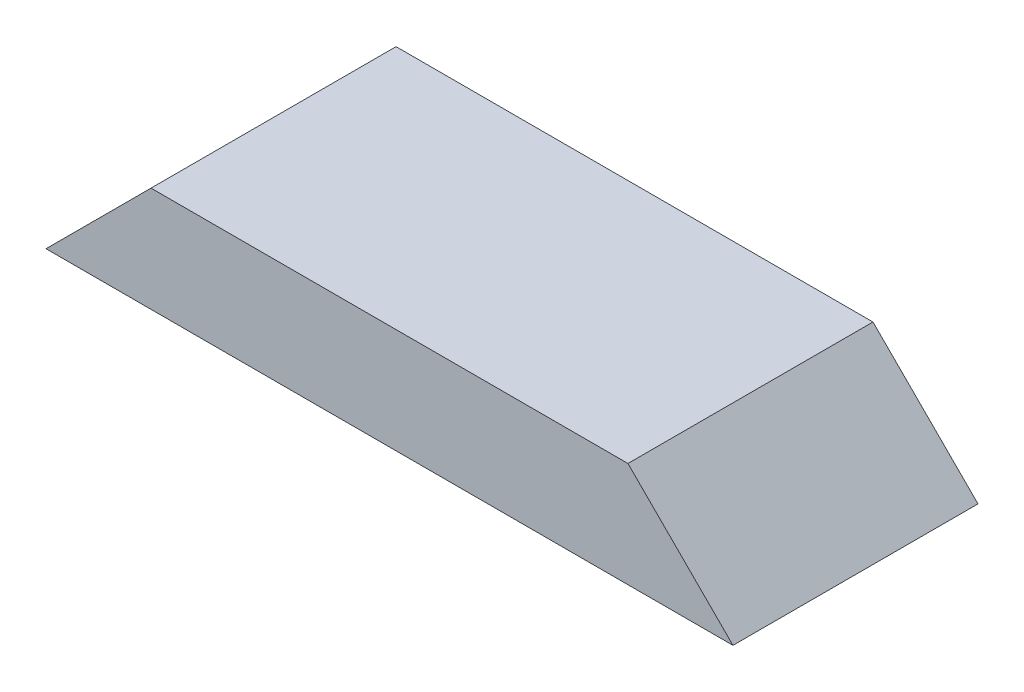
ISO-10303-21;
HEADER;
FILE_DESCRIPTION(('STEP AP214'),'2;1');
FILE_NAME('part.step','',(''),(''),'','','');
FILE_SCHEMA(('AUTOMOTIVE_DESIGN { 1 0 10303 214 1 1 1 1 }'));
ENDSEC;
DATA;
#1=APPLICATION_CONTEXT('core data for automotive mechanical design processes');
#2=APPLICATION_PROTOCOL_DEFINITION('international standard','automotive_design',2000,#1);
#3=PRODUCT_CONTEXT('',#1,'mechanical');
#4=PRODUCT('Part','Part','',(#3));
#5=PRODUCT_RELATED_PRODUCT_CATEGORY('part','',(#4));
#6=PRODUCT_DEFINITION_FORMATION('','',#4);
#7=PRODUCT_DEFINITION_CONTEXT('part definition',#1,'design');
#8=PRODUCT_DEFINITION('design','',#6,#7);
#9=PRODUCT_DEFINITION_SHAPE('','',#8);
#10=(LENGTH_UNIT() NAMED_UNIT(*) SI_UNIT(.MILLI.,.METRE.));
#11=(NAMED_UNIT(*) PLANE_ANGLE_UNIT() SI_UNIT($,.RADIAN.));
#12=(NAMED_UNIT(*) SI_UNIT($,.STERADIAN.) SOLID_ANGLE_UNIT());
#13=UNCERTAINTY_MEASURE_WITH_UNIT(LENGTH_MEASURE(1.E-05),#10,'distance_accuracy_value','');
#14=(GEOMETRIC_REPRESENTATION_CONTEXT(3) GLOBAL_UNCERTAINTY_ASSIGNED_CONTEXT((#13)) GLOBAL_UNIT_ASSIGNED_CONTEXT((#10,
#11,#12)) REPRESENTATION_CONTEXT('',''));
#15=CARTESIAN_POINT('',(0.,0.,0.));
#16=DIRECTION('',(0.,0.,1.));
#17=DIRECTION('',(1.,0.,0.));
#18=AXIS2_PLACEMENT_3D('',#15,#16,#17);
#19=CARTESIAN_POINT('',(0.,38.1,0.));
#20=DIRECTION('',(0.,0.,-1.));
#21=DIRECTION('',(-1.,0.,0.));
#22=AXIS2_PLACEMENT_3D('',#19,#20,#21);
#23=PLANE('',#22);
#24=DIRECTION('',(1.,0.,0.));
#25=VECTOR('',#24,1.);
#26=CARTESIAN_POINT('',(0.,38.1,0.));
#27=LINE('',#26,#25);
#28=CARTESIAN_POINT('',(38.1,38.1,0.));
#29=VERTEX_POINT('',#28);
#30=CARTESIAN_POINT('',(211.1375,38.1,0.));
#31=VERTEX_POINT('',#30);
#32=EDGE_CURVE('E46',#29,#31,#27,.T.);
#33=ORIENTED_EDGE('',*,*,#32,.F.);
#34=DIRECTION('',(0.707106781186547,0.707106781186547,0.));
#35=VECTOR('',#34,1.);
#36=CARTESIAN_POINT('',(0.,0.,0.));
#37=LINE('',#36,#35);
#38=CARTESIAN_POINT('',(0.,0.,0.));
#39=VERTEX_POINT('',#38);
#40=EDGE_CURVE('E81',#39,#29,#37,.T.);
#41=ORIENTED_EDGE('',*,*,#40,.F.);
#42=DIRECTION('',(1.,0.,0.));
#43=VECTOR('',#42,1.);
#44=CARTESIAN_POINT('',(0.,0.,0.));
#45=LINE('',#44,#43);
#46=CARTESIAN_POINT('',(249.2375,0.,0.));
#47=VERTEX_POINT('',#46);
#48=EDGE_CURVE('E86',#39,#47,#45,.T.);
#49=ORIENTED_EDGE('',*,*,#48,.T.);
#50=DIRECTION('',(0.707106781186547,-0.707106781186548,0.));
#51=VECTOR('',#50,1.);
#52=CARTESIAN_POINT('',(249.2375,0.,0.));
#53=LINE('',#52,#51);
#54=EDGE_CURVE('E62',#31,#47,#53,.T.);
#55=ORIENTED_EDGE('',*,*,#54,.F.);
#56=EDGE_LOOP('',(#33,#41,#49,#55));
#57=FACE_BOUND('',#56,.T.);
#58=ADVANCED_FACE('F38',(#57),#23,.F.);
#59=CARTESIAN_POINT('',(0.,38.1,-88.9));
#60=DIRECTION('',(0.,0.,1.));
#61=DIRECTION('',(1.,0.,0.));
#62=AXIS2_PLACEMENT_3D('',#59,#60,#61);
#63=PLANE('',#62);
#64=DIRECTION('',(-1.,0.,0.));
#65=VECTOR('',#64,1.);
#66=CARTESIAN_POINT('',(0.,0.,-88.9));
#67=LINE('',#66,#65);
#68=CARTESIAN_POINT('',(249.2375,0.,-88.9));
#69=VERTEX_POINT('',#68);
#70=CARTESIAN_POINT('',(0.,0.,-88.9));
#71=VERTEX_POINT('',#70);
#72=EDGE_CURVE('E41',#69,#71,#67,.T.);
#73=ORIENTED_EDGE('',*,*,#72,.T.);
#74=DIRECTION('',(0.707106781186547,0.707106781186547,0.));
#75=VECTOR('',#74,1.);
#76=CARTESIAN_POINT('',(0.,0.,-88.9));
#77=LINE('',#76,#75);
#78=CARTESIAN_POINT('',(38.1,38.1,-88.9));
#79=VERTEX_POINT('',#78);
#80=EDGE_CURVE('E54',#71,#79,#77,.T.);
#81=ORIENTED_EDGE('',*,*,#80,.T.);
#82=DIRECTION('',(-1.,0.,0.));
#83=VECTOR('',#82,1.);
#84=CARTESIAN_POINT('',(0.,38.1,-88.9));
#85=LINE('',#84,#83);
#86=CARTESIAN_POINT('',(211.1375,38.1,-88.9));
#87=VERTEX_POINT('',#86);
#88=EDGE_CURVE('E11',#87,#79,#85,.T.);
#89=ORIENTED_EDGE('',*,*,#88,.F.);
#90=DIRECTION('',(0.707106781186547,-0.707106781186548,0.));
#91=VECTOR('',#90,1.);
#92=CARTESIAN_POINT('',(249.2375,0.,-88.9));
#93=LINE('',#92,#91);
#94=EDGE_CURVE('E99',#87,#69,#93,.T.);
#95=ORIENTED_EDGE('',*,*,#94,.T.);
#96=EDGE_LOOP('',(#73,#81,#89,#95));
#97=FACE_BOUND('',#96,.T.);
#98=ADVANCED_FACE('F108',(#97),#63,.F.);
#99=CARTESIAN_POINT('',(0.,38.1,0.));
#100=DIRECTION('',(0.,-1.,0.));
#101=DIRECTION('',(0.,0.,-1.));
#102=AXIS2_PLACEMENT_3D('',#99,#100,#101);
#103=PLANE('',#102);
#104=ORIENTED_EDGE('',*,*,#88,.T.);
#105=DIRECTION('',(0.,0.,1.));
#106=VECTOR('',#105,1.);
#107=CARTESIAN_POINT('',(38.1,38.1,-88.9));
#108=LINE('',#107,#106);
#109=EDGE_CURVE('E87',#79,#29,#108,.T.);
#110=ORIENTED_EDGE('',*,*,#109,.T.);
#111=ORIENTED_EDGE('',*,*,#32,.T.);
#112=DIRECTION('',(0.,0.,1.));
#113=VECTOR('',#112,1.);
#114=CARTESIAN_POINT('',(211.1375,38.1,-88.9));
#115=LINE('',#114,#113);
#116=EDGE_CURVE('E102',#87,#31,#115,.T.);
#117=ORIENTED_EDGE('',*,*,#116,.F.);
#118=EDGE_LOOP('',(#104,#110,#111,#117));
#119=FACE_BOUND('',#118,.T.);
#120=ADVANCED_FACE('F111',(#119),#103,.F.);
#121=CARTESIAN_POINT('',(0.,0.,0.));
#122=DIRECTION('',(0.,-1.,0.));
#123=DIRECTION('',(0.,0.,-1.));
#124=AXIS2_PLACEMENT_3D('',#121,#122,#123);
#125=PLANE('',#124);
#126=DIRECTION('',(0.,0.,1.));
#127=VECTOR('',#126,1.);
#128=CARTESIAN_POINT('',(0.,0.,0.));
#129=LINE('',#128,#127);
#130=EDGE_CURVE('E78',#71,#39,#129,.T.);
#131=ORIENTED_EDGE('',*,*,#130,.F.);
#132=ORIENTED_EDGE('',*,*,#72,.F.);
#133=DIRECTION('',(0.,0.,-1.));
#134=VECTOR('',#133,1.);
#135=CARTESIAN_POINT('',(249.2375,0.,0.));
#136=LINE('',#135,#134);
#137=EDGE_CURVE('E95',#47,#69,#136,.T.);
#138=ORIENTED_EDGE('',*,*,#137,.F.);
#139=ORIENTED_EDGE('',*,*,#48,.F.);
#140=EDGE_LOOP('',(#131,#132,#138,#139));
#141=FACE_BOUND('',#140,.T.);
#142=ADVANCED_FACE('F94',(#141),#125,.T.);
#143=CARTESIAN_POINT('',(249.2375,0.,-88.9));
#144=DIRECTION('',(-0.707106781186548,-0.707106781186547,0.));
#145=DIRECTION('',(0.707106781186547,-0.707106781186548,0.));
#146=AXIS2_PLACEMENT_3D('',#143,#144,#145);
#147=PLANE('',#146);
#148=ORIENTED_EDGE('',*,*,#54,.T.);
#149=ORIENTED_EDGE('',*,*,#137,.T.);
#150=ORIENTED_EDGE('',*,*,#94,.F.);
#151=ORIENTED_EDGE('',*,*,#116,.T.);
#152=EDGE_LOOP('',(#148,#149,#150,#151));
#153=FACE_BOUND('',#152,.T.);
#154=ADVANCED_FACE('F112',(#153),#147,.F.);
#155=CARTESIAN_POINT('',(0.,0.,-88.9));
#156=DIRECTION('',(0.707106781186547,-0.707106781186547,0.));
#157=DIRECTION('',(0.707106781186548,0.707106781186548,0.));
#158=AXIS2_PLACEMENT_3D('',#155,#156,#157);
#159=PLANE('',#158);
#160=ORIENTED_EDGE('',*,*,#40,.T.);
#161=ORIENTED_EDGE('',*,*,#109,.F.);
#162=ORIENTED_EDGE('',*,*,#80,.F.);
#163=ORIENTED_EDGE('',*,*,#130,.T.);
#164=EDGE_LOOP('',(#160,#161,#162,#163));
#165=FACE_BOUND('',#164,.T.);
#166=ADVANCED_FACE('F80',(#165),#159,.F.);
#167=CLOSED_SHELL('',(#58,#98,#120,#142,#154,#166));
#168=MANIFOLD_SOLID_BREP('B2',#167);
#169=ADVANCED_BREP_SHAPE_REPRESENTATION('',(#18,#168),#14);
#170=SHAPE_DEFINITION_REPRESENTATION(#9,#169);
ENDSEC;
END-ISO-10303-21;
